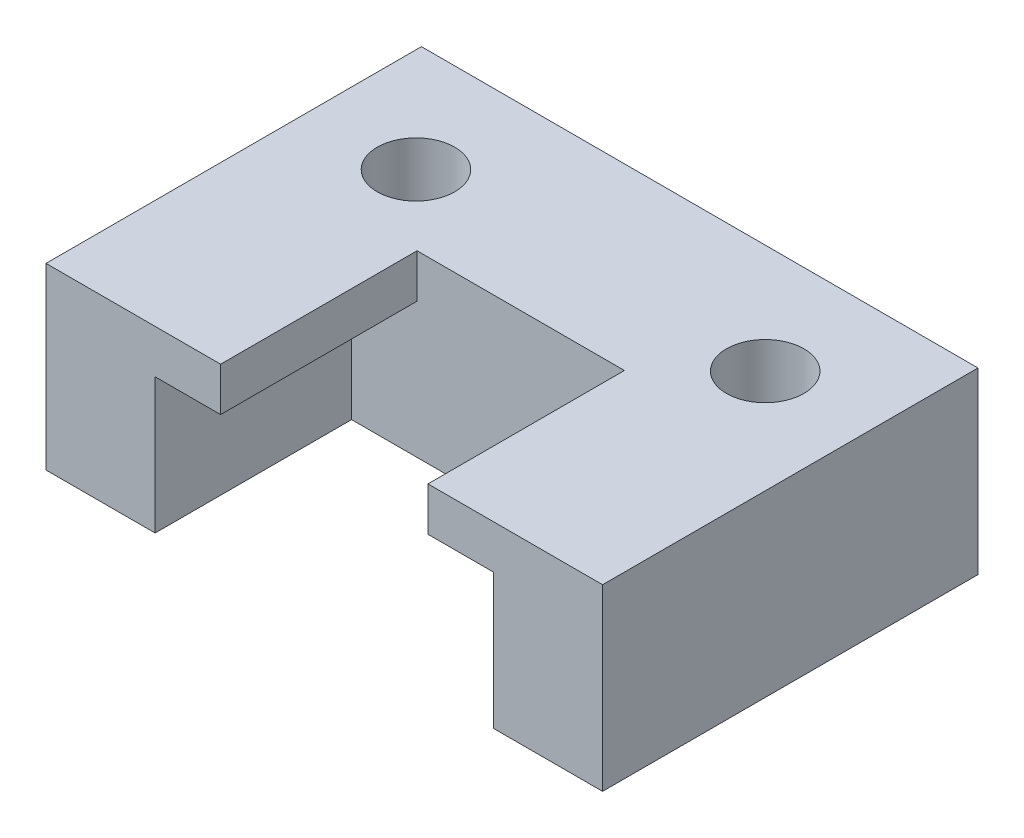
ISO-10303-21;
HEADER;
FILE_DESCRIPTION(('STEP AP214'),'2;1');
FILE_NAME('part.step','',(''),(''),'','','');
FILE_SCHEMA(('AUTOMOTIVE_DESIGN { 1 0 10303 214 1 1 1 1 }'));
ENDSEC;
DATA;
#1=APPLICATION_CONTEXT('core data for automotive mechanical design processes');
#2=APPLICATION_PROTOCOL_DEFINITION('international standard','automotive_design',2000,#1);
#3=PRODUCT_CONTEXT('',#1,'mechanical');
#4=PRODUCT('Part','Part','',(#3));
#5=PRODUCT_RELATED_PRODUCT_CATEGORY('part','',(#4));
#6=PRODUCT_DEFINITION_FORMATION('','',#4);
#7=PRODUCT_DEFINITION_CONTEXT('part definition',#1,'design');
#8=PRODUCT_DEFINITION('design','',#6,#7);
#9=PRODUCT_DEFINITION_SHAPE('','',#8);
#10=(LENGTH_UNIT() NAMED_UNIT(*) SI_UNIT(.MILLI.,.METRE.));
#11=(NAMED_UNIT(*) PLANE_ANGLE_UNIT() SI_UNIT($,.RADIAN.));
#12=(NAMED_UNIT(*) SI_UNIT($,.STERADIAN.) SOLID_ANGLE_UNIT());
#13=UNCERTAINTY_MEASURE_WITH_UNIT(LENGTH_MEASURE(1.E-05),#10,'distance_accuracy_value','');
#14=(GEOMETRIC_REPRESENTATION_CONTEXT(3) GLOBAL_UNCERTAINTY_ASSIGNED_CONTEXT((#13)) GLOBAL_UNIT_ASSIGNED_CONTEXT((#10,
#11,#12)) REPRESENTATION_CONTEXT('',''));
#15=CARTESIAN_POINT('',(0.,0.,0.));
#16=DIRECTION('',(0.,0.,1.));
#17=DIRECTION('',(1.,0.,0.));
#18=AXIS2_PLACEMENT_3D('',#15,#16,#17);
#19=CARTESIAN_POINT('',(-12.75,6.2,0.));
#20=DIRECTION('',(-1.,0.,0.));
#21=DIRECTION('',(0.,0.,1.));
#22=AXIS2_PLACEMENT_3D('',#19,#20,#21);
#23=PLANE('',#22);
#24=DIRECTION('',(0.,0.,-1.));
#25=VECTOR('',#24,1.);
#26=CARTESIAN_POINT('',(-12.75,0.,0.));
#27=LINE('',#26,#25);
#28=CARTESIAN_POINT('',(-12.75,0.,12.2));
#29=VERTEX_POINT('',#28);
#30=CARTESIAN_POINT('',(-12.75,0.,-5.));
#31=VERTEX_POINT('',#30);
#32=EDGE_CURVE('E168',#29,#31,#27,.T.);
#33=ORIENTED_EDGE('',*,*,#32,.F.);
#34=DIRECTION('',(0.,-1.,0.));
#35=VECTOR('',#34,1.);
#36=CARTESIAN_POINT('',(-12.75,6.2,12.2));
#37=LINE('',#36,#35);
#38=CARTESIAN_POINT('',(-12.75,8.2,12.2));
#39=VERTEX_POINT('',#38);
#40=EDGE_CURVE('E12',#39,#29,#37,.T.);
#41=ORIENTED_EDGE('',*,*,#40,.F.);
#42=DIRECTION('',(0.,0.,1.));
#43=VECTOR('',#42,1.);
#44=CARTESIAN_POINT('',(-12.75,8.2,0.));
#45=LINE('',#44,#43);
#46=CARTESIAN_POINT('',(-12.75,8.2,-5.));
#47=VERTEX_POINT('',#46);
#48=EDGE_CURVE('E291',#47,#39,#45,.T.);
#49=ORIENTED_EDGE('',*,*,#48,.F.);
#50=DIRECTION('',(0.,-1.,0.));
#51=VECTOR('',#50,1.);
#52=CARTESIAN_POINT('',(-12.75,6.2,-5.));
#53=LINE('',#52,#51);
#54=EDGE_CURVE('E153',#47,#31,#53,.T.);
#55=ORIENTED_EDGE('',*,*,#54,.T.);
#56=EDGE_LOOP('',(#33,#41,#49,#55));
#57=FACE_BOUND('',#56,.T.);
#58=ADVANCED_FACE('F95',(#57),#23,.T.);
#59=CARTESIAN_POINT('',(0.,6.2,12.2));
#60=DIRECTION('',(0.,0.,1.));
#61=DIRECTION('',(1.,0.,0.));
#62=AXIS2_PLACEMENT_3D('',#59,#60,#61);
#63=PLANE('',#62);
#64=DIRECTION('',(-1.,0.,0.));
#65=VECTOR('',#64,1.);
#66=CARTESIAN_POINT('',(0.,0.,12.2));
#67=LINE('',#66,#65);
#68=CARTESIAN_POINT('',(-7.75,0.,12.2));
#69=VERTEX_POINT('',#68);
#70=EDGE_CURVE('E197',#69,#29,#67,.T.);
#71=ORIENTED_EDGE('',*,*,#70,.F.);
#72=DIRECTION('',(0.,-1.,0.));
#73=VECTOR('',#72,1.);
#74=CARTESIAN_POINT('',(-7.75,6.2,12.2));
#75=LINE('',#74,#73);
#76=CARTESIAN_POINT('',(-7.75,6.2,12.2));
#77=VERTEX_POINT('',#76);
#78=EDGE_CURVE('E104',#77,#69,#75,.T.);
#79=ORIENTED_EDGE('',*,*,#78,.F.);
#80=DIRECTION('',(1.,0.,0.));
#81=VECTOR('',#80,1.);
#82=CARTESIAN_POINT('',(0.,6.2,12.2));
#83=LINE('',#82,#81);
#84=CARTESIAN_POINT('',(-4.75,6.2,12.2));
#85=VERTEX_POINT('',#84);
#86=EDGE_CURVE('E282',#77,#85,#83,.T.);
#87=ORIENTED_EDGE('',*,*,#86,.T.);
#88=DIRECTION('',(0.,-1.,0.));
#89=VECTOR('',#88,1.);
#90=CARTESIAN_POINT('',(-4.75,8.2,12.2));
#91=LINE('',#90,#89);
#92=CARTESIAN_POINT('',(-4.75,8.2,12.2));
#93=VERTEX_POINT('',#92);
#94=EDGE_CURVE('E306',#93,#85,#91,.T.);
#95=ORIENTED_EDGE('',*,*,#94,.F.);
#96=DIRECTION('',(1.,0.,0.));
#97=VECTOR('',#96,1.);
#98=CARTESIAN_POINT('',(0.,8.2,12.2));
#99=LINE('',#98,#97);
#100=EDGE_CURVE('E289',#39,#93,#99,.T.);
#101=ORIENTED_EDGE('',*,*,#100,.F.);
#102=ORIENTED_EDGE('',*,*,#40,.T.);
#103=EDGE_LOOP('',(#71,#79,#87,#95,#101,#102));
#104=FACE_BOUND('',#103,.T.);
#105=ADVANCED_FACE('F198',(#104),#63,.T.);
#106=CARTESIAN_POINT('',(-7.75,6.2,0.));
#107=DIRECTION('',(1.,0.,0.));
#108=DIRECTION('',(0.,0.,-1.));
#109=AXIS2_PLACEMENT_3D('',#106,#107,#108);
#110=PLANE('',#109);
#111=DIRECTION('',(0.,0.,1.));
#112=VECTOR('',#111,1.);
#113=CARTESIAN_POINT('',(-7.75,0.,0.));
#114=LINE('',#113,#112);
#115=CARTESIAN_POINT('',(-7.75,0.,3.2));
#116=VERTEX_POINT('',#115);
#117=EDGE_CURVE('E191',#116,#69,#114,.T.);
#118=ORIENTED_EDGE('',*,*,#117,.F.);
#119=DIRECTION('',(0.,-1.,0.));
#120=VECTOR('',#119,1.);
#121=CARTESIAN_POINT('',(-7.75,6.2,3.2));
#122=LINE('',#121,#120);
#123=CARTESIAN_POINT('',(-7.75,6.2,3.2));
#124=VERTEX_POINT('',#123);
#125=EDGE_CURVE('E183',#124,#116,#122,.T.);
#126=ORIENTED_EDGE('',*,*,#125,.F.);
#127=DIRECTION('',(0.,0.,1.));
#128=VECTOR('',#127,1.);
#129=CARTESIAN_POINT('',(-7.75,6.2,0.));
#130=LINE('',#129,#128);
#131=EDGE_CURVE('E169',#124,#77,#130,.T.);
#132=ORIENTED_EDGE('',*,*,#131,.T.);
#133=ORIENTED_EDGE('',*,*,#78,.T.);
#134=EDGE_LOOP('',(#118,#126,#132,#133));
#135=FACE_BOUND('',#134,.T.);
#136=ADVANCED_FACE('F188',(#135),#110,.T.);
#137=CARTESIAN_POINT('',(0.,6.2,3.2));
#138=DIRECTION('',(0.,0.,1.));
#139=DIRECTION('',(1.,0.,0.));
#140=AXIS2_PLACEMENT_3D('',#137,#138,#139);
#141=PLANE('',#140);
#142=DIRECTION('',(-1.,0.,0.));
#143=VECTOR('',#142,1.);
#144=CARTESIAN_POINT('',(0.,0.,3.2));
#145=LINE('',#144,#143);
#146=CARTESIAN_POINT('',(7.75,0.,3.2));
#147=VERTEX_POINT('',#146);
#148=EDGE_CURVE('E204',#147,#116,#145,.T.);
#149=ORIENTED_EDGE('',*,*,#148,.F.);
#150=DIRECTION('',(0.,-1.,0.));
#151=VECTOR('',#150,1.);
#152=CARTESIAN_POINT('',(7.75,6.2,3.2));
#153=LINE('',#152,#151);
#154=CARTESIAN_POINT('',(7.75,6.2,3.2));
#155=VERTEX_POINT('',#154);
#156=EDGE_CURVE('E181',#155,#147,#153,.T.);
#157=ORIENTED_EDGE('',*,*,#156,.F.);
#158=DIRECTION('',(-1.,0.,0.));
#159=VECTOR('',#158,1.);
#160=CARTESIAN_POINT('',(0.,6.2,3.2));
#161=LINE('',#160,#159);
#162=CARTESIAN_POINT('',(4.75,6.2,3.2));
#163=VERTEX_POINT('',#162);
#164=EDGE_CURVE('E111',#155,#163,#161,.T.);
#165=ORIENTED_EDGE('',*,*,#164,.T.);
#166=DIRECTION('',(0.,-1.,0.));
#167=VECTOR('',#166,1.);
#168=CARTESIAN_POINT('',(4.75,8.2,3.2));
#169=LINE('',#168,#167);
#170=CARTESIAN_POINT('',(4.75,8.2,3.2));
#171=VERTEX_POINT('',#170);
#172=EDGE_CURVE('E273',#171,#163,#169,.T.);
#173=ORIENTED_EDGE('',*,*,#172,.F.);
#174=DIRECTION('',(1.,0.,0.));
#175=VECTOR('',#174,1.);
#176=CARTESIAN_POINT('',(0.,8.2,3.2));
#177=LINE('',#176,#175);
#178=CARTESIAN_POINT('',(-4.75,8.2,3.2));
#179=VERTEX_POINT('',#178);
#180=EDGE_CURVE('E264',#179,#171,#177,.T.);
#181=ORIENTED_EDGE('',*,*,#180,.F.);
#182=DIRECTION('',(0.,-1.,0.));
#183=VECTOR('',#182,1.);
#184=CARTESIAN_POINT('',(-4.75,8.2,3.2));
#185=LINE('',#184,#183);
#186=CARTESIAN_POINT('',(-4.75,6.2,3.2));
#187=VERTEX_POINT('',#186);
#188=EDGE_CURVE('E276',#179,#187,#185,.T.);
#189=ORIENTED_EDGE('',*,*,#188,.T.);
#190=EDGE_CURVE('E172',#187,#124,#161,.T.);
#191=ORIENTED_EDGE('',*,*,#190,.T.);
#192=ORIENTED_EDGE('',*,*,#125,.T.);
#193=EDGE_LOOP('',(#149,#157,#165,#173,#181,#189,#191,#192));
#194=FACE_BOUND('',#193,.T.);
#195=ADVANCED_FACE('F226',(#194),#141,.T.);
#196=CARTESIAN_POINT('',(7.75,6.2,0.));
#197=DIRECTION('',(-1.,0.,0.));
#198=DIRECTION('',(0.,0.,1.));
#199=AXIS2_PLACEMENT_3D('',#196,#197,#198);
#200=PLANE('',#199);
#201=DIRECTION('',(0.,0.,-1.));
#202=VECTOR('',#201,1.);
#203=CARTESIAN_POINT('',(7.75,0.,0.));
#204=LINE('',#203,#202);
#205=CARTESIAN_POINT('',(7.75,0.,12.2));
#206=VERTEX_POINT('',#205);
#207=EDGE_CURVE('E206',#206,#147,#204,.T.);
#208=ORIENTED_EDGE('',*,*,#207,.F.);
#209=DIRECTION('',(0.,-1.,0.));
#210=VECTOR('',#209,1.);
#211=CARTESIAN_POINT('',(7.75,6.2,12.2));
#212=LINE('',#211,#210);
#213=CARTESIAN_POINT('',(7.75,6.2,12.2));
#214=VERTEX_POINT('',#213);
#215=EDGE_CURVE('E179',#214,#206,#212,.T.);
#216=ORIENTED_EDGE('',*,*,#215,.F.);
#217=DIRECTION('',(0.,0.,-1.));
#218=VECTOR('',#217,1.);
#219=CARTESIAN_POINT('',(7.75,6.2,0.));
#220=LINE('',#219,#218);
#221=EDGE_CURVE('E176',#214,#155,#220,.T.);
#222=ORIENTED_EDGE('',*,*,#221,.T.);
#223=ORIENTED_EDGE('',*,*,#156,.T.);
#224=EDGE_LOOP('',(#208,#216,#222,#223));
#225=FACE_BOUND('',#224,.T.);
#226=ADVANCED_FACE('F224',(#225),#200,.T.);
#227=CARTESIAN_POINT('',(0.,6.2,12.2));
#228=DIRECTION('',(0.,0.,1.));
#229=DIRECTION('',(1.,0.,0.));
#230=AXIS2_PLACEMENT_3D('',#227,#228,#229);
#231=PLANE('',#230);
#232=DIRECTION('',(-1.,0.,0.));
#233=VECTOR('',#232,1.);
#234=CARTESIAN_POINT('',(0.,0.,12.2));
#235=LINE('',#234,#233);
#236=CARTESIAN_POINT('',(12.75,0.,12.2));
#237=VERTEX_POINT('',#236);
#238=EDGE_CURVE('E162',#237,#206,#235,.T.);
#239=ORIENTED_EDGE('',*,*,#238,.F.);
#240=DIRECTION('',(0.,-1.,0.));
#241=VECTOR('',#240,1.);
#242=CARTESIAN_POINT('',(12.75,6.2,12.2));
#243=LINE('',#242,#241);
#244=CARTESIAN_POINT('',(12.75,8.2,12.2));
#245=VERTEX_POINT('',#244);
#246=EDGE_CURVE('E152',#245,#237,#243,.T.);
#247=ORIENTED_EDGE('',*,*,#246,.F.);
#248=DIRECTION('',(1.,0.,0.));
#249=VECTOR('',#248,1.);
#250=CARTESIAN_POINT('',(0.,8.2,12.2));
#251=LINE('',#250,#249);
#252=CARTESIAN_POINT('',(4.75,8.2,12.2));
#253=VERTEX_POINT('',#252);
#254=EDGE_CURVE('E277',#253,#245,#251,.T.);
#255=ORIENTED_EDGE('',*,*,#254,.F.);
#256=DIRECTION('',(0.,-1.,0.));
#257=VECTOR('',#256,1.);
#258=CARTESIAN_POINT('',(4.75,8.2,12.2));
#259=LINE('',#258,#257);
#260=CARTESIAN_POINT('',(4.75,6.2,12.2));
#261=VERTEX_POINT('',#260);
#262=EDGE_CURVE('E280',#253,#261,#259,.T.);
#263=ORIENTED_EDGE('',*,*,#262,.T.);
#264=DIRECTION('',(1.,0.,0.));
#265=VECTOR('',#264,1.);
#266=CARTESIAN_POINT('',(0.,6.2,12.2));
#267=LINE('',#266,#265);
#268=EDGE_CURVE('E221',#261,#214,#267,.T.);
#269=ORIENTED_EDGE('',*,*,#268,.T.);
#270=ORIENTED_EDGE('',*,*,#215,.T.);
#271=EDGE_LOOP('',(#239,#247,#255,#263,#269,#270));
#272=FACE_BOUND('',#271,.T.);
#273=ADVANCED_FACE('F212',(#272),#231,.T.);
#274=CARTESIAN_POINT('',(12.75,6.2,0.));
#275=DIRECTION('',(1.,0.,0.));
#276=DIRECTION('',(0.,0.,-1.));
#277=AXIS2_PLACEMENT_3D('',#274,#275,#276);
#278=PLANE('',#277);
#279=DIRECTION('',(0.,0.,1.));
#280=VECTOR('',#279,1.);
#281=CARTESIAN_POINT('',(12.75,0.,0.));
#282=LINE('',#281,#280);
#283=CARTESIAN_POINT('',(12.75,0.,-5.));
#284=VERTEX_POINT('',#283);
#285=EDGE_CURVE('E156',#284,#237,#282,.T.);
#286=ORIENTED_EDGE('',*,*,#285,.F.);
#287=DIRECTION('',(0.,-1.,0.));
#288=VECTOR('',#287,1.);
#289=CARTESIAN_POINT('',(12.75,6.2,-5.));
#290=LINE('',#289,#288);
#291=CARTESIAN_POINT('',(12.75,8.2,-5.));
#292=VERTEX_POINT('',#291);
#293=EDGE_CURVE('E140',#292,#284,#290,.T.);
#294=ORIENTED_EDGE('',*,*,#293,.F.);
#295=DIRECTION('',(0.,0.,-1.));
#296=VECTOR('',#295,1.);
#297=CARTESIAN_POINT('',(12.75,8.2,0.));
#298=LINE('',#297,#296);
#299=EDGE_CURVE('E295',#245,#292,#298,.T.);
#300=ORIENTED_EDGE('',*,*,#299,.F.);
#301=ORIENTED_EDGE('',*,*,#246,.T.);
#302=EDGE_LOOP('',(#286,#294,#300,#301));
#303=FACE_BOUND('',#302,.T.);
#304=ADVANCED_FACE('F157',(#303),#278,.T.);
#305=CARTESIAN_POINT('',(-8.,6.2,0.));
#306=DIRECTION('',(0.,-1.,0.));
#307=DIRECTION('',(0.,0.,-1.));
#308=AXIS2_PLACEMENT_3D('',#305,#306,#307);
#309=CYLINDRICAL_SURFACE('',#308,1.775);
#310=CARTESIAN_POINT('',(-8.,0.,0.));
#311=DIRECTION('',(0.,1.,0.));
#312=DIRECTION('',(0.,0.,1.));
#313=AXIS2_PLACEMENT_3D('',#310,#311,#312);
#314=CIRCLE('',#313,1.775);
#315=CARTESIAN_POINT('',(-8.,0.,-1.775));
#316=VERTEX_POINT('',#315);
#317=EDGE_CURVE('E314',#316,#316,#314,.T.);
#318=CARTESIAN_POINT('',(-8.,8.2,0.));
#319=DIRECTION('',(0.,1.,0.));
#320=DIRECTION('',(0.,0.,1.));
#321=AXIS2_PLACEMENT_3D('',#318,#319,#320);
#322=CIRCLE('',#321,1.775);
#323=CARTESIAN_POINT('',(-8.,8.2,-1.775));
#324=VERTEX_POINT('',#323);
#325=EDGE_CURVE('E324',#324,#324,#322,.T.);
#326=CARTESIAN_POINT('',(-8.,0.,-1.775));
#327=CARTESIAN_POINT('',(-8.,0.0854166666666664,-1.775));
#328=CARTESIAN_POINT('',(-8.,0.170833333333333,-1.775));
#329=CARTESIAN_POINT('',(-8.,0.341666666666666,-1.775));
#330=CARTESIAN_POINT('',(-8.,0.427083333333333,-1.775));
#331=CARTESIAN_POINT('',(-8.,0.597916666666667,-1.775));
#332=CARTESIAN_POINT('',(-8.,0.683333333333334,-1.775));
#333=CARTESIAN_POINT('',(-8.,0.854166666666667,-1.775));
#334=CARTESIAN_POINT('',(-8.,0.939583333333333,-1.775));
#335=CARTESIAN_POINT('',(-8.,1.11041666666667,-1.775));
#336=CARTESIAN_POINT('',(-8.,1.19583333333333,-1.775));
#337=CARTESIAN_POINT('',(-8.,1.36666666666667,-1.775));
#338=CARTESIAN_POINT('',(-8.,1.45208333333333,-1.775));
#339=CARTESIAN_POINT('',(-8.,1.62291666666667,-1.775));
#340=CARTESIAN_POINT('',(-8.,1.70833333333333,-1.775));
#341=CARTESIAN_POINT('',(-8.,1.87916666666667,-1.775));
#342=CARTESIAN_POINT('',(-8.,1.96458333333333,-1.775));
#343=CARTESIAN_POINT('',(-8.,2.13541666666667,-1.775));
#344=CARTESIAN_POINT('',(-8.,2.22083333333333,-1.775));
#345=CARTESIAN_POINT('',(-8.,2.39166666666667,-1.775));
#346=CARTESIAN_POINT('',(-8.,2.47708333333333,-1.775));
#347=CARTESIAN_POINT('',(-8.,2.64791666666667,-1.775));
#348=CARTESIAN_POINT('',(-8.,2.73333333333333,-1.775));
#349=CARTESIAN_POINT('',(-8.,2.90416666666667,-1.775));
#350=CARTESIAN_POINT('',(-8.,2.98958333333333,-1.775));
#351=CARTESIAN_POINT('',(-8.,3.16041666666667,-1.775));
#352=CARTESIAN_POINT('',(-8.,3.24583333333333,-1.775));
#353=CARTESIAN_POINT('',(-8.,3.41666666666667,-1.775));
#354=CARTESIAN_POINT('',(-8.,3.50208333333333,-1.775));
#355=CARTESIAN_POINT('',(-8.,3.67291666666667,-1.775));
#356=CARTESIAN_POINT('',(-8.,3.75833333333333,-1.775));
#357=CARTESIAN_POINT('',(-8.,3.92916666666667,-1.775));
#358=CARTESIAN_POINT('',(-8.,4.01458333333333,-1.775));
#359=CARTESIAN_POINT('',(-8.,4.18541666666667,-1.775));
#360=CARTESIAN_POINT('',(-8.,4.27083333333333,-1.775));
#361=CARTESIAN_POINT('',(-8.,4.44166666666666,-1.775));
#362=CARTESIAN_POINT('',(-8.,4.52708333333333,-1.775));
#363=CARTESIAN_POINT('',(-8.,4.69791666666667,-1.775));
#364=CARTESIAN_POINT('',(-8.,4.78333333333333,-1.775));
#365=CARTESIAN_POINT('',(-8.,4.95416666666667,-1.775));
#366=CARTESIAN_POINT('',(-8.,5.03958333333333,-1.775));
#367=CARTESIAN_POINT('',(-8.,5.21041666666667,-1.775));
#368=CARTESIAN_POINT('',(-8.,5.29583333333333,-1.775));
#369=CARTESIAN_POINT('',(-8.,5.46666666666667,-1.775));
#370=CARTESIAN_POINT('',(-8.,5.55208333333333,-1.775));
#371=CARTESIAN_POINT('',(-8.,5.72291666666667,-1.775));
#372=CARTESIAN_POINT('',(-8.,5.80833333333333,-1.775));
#373=CARTESIAN_POINT('',(-8.,5.97916666666667,-1.775));
#374=CARTESIAN_POINT('',(-8.,6.06458333333333,-1.775));
#375=CARTESIAN_POINT('',(-8.,6.23541666666666,-1.775));
#376=CARTESIAN_POINT('',(-8.,6.32083333333333,-1.775));
#377=CARTESIAN_POINT('',(-8.,6.49166666666666,-1.775));
#378=CARTESIAN_POINT('',(-8.,6.57708333333333,-1.775));
#379=CARTESIAN_POINT('',(-8.,6.74791666666667,-1.775));
#380=CARTESIAN_POINT('',(-8.,6.83333333333333,-1.775));
#381=CARTESIAN_POINT('',(-8.,7.00416666666667,-1.775));
#382=CARTESIAN_POINT('',(-8.,7.08958333333333,-1.775));
#383=CARTESIAN_POINT('',(-8.,7.26041666666667,-1.775));
#384=CARTESIAN_POINT('',(-8.,7.34583333333333,-1.775));
#385=CARTESIAN_POINT('',(-8.,7.51666666666666,-1.775));
#386=CARTESIAN_POINT('',(-8.,7.60208333333333,-1.775));
#387=CARTESIAN_POINT('',(-8.,7.77291666666667,-1.775));
#388=CARTESIAN_POINT('',(-8.,7.85833333333333,-1.775));
#389=CARTESIAN_POINT('',(-8.,8.02916666666666,-1.775));
#390=CARTESIAN_POINT('',(-8.,8.11458333333333,-1.775));
#391=CARTESIAN_POINT('',(-8.,8.2,-1.775));
#392=B_SPLINE_CURVE_WITH_KNOTS('',3,(#326,#327,#328,#329,#330,#331,#332,#333,#334,#335,#336,
#337,#338,#339,#340,#341,#342,#343,#344,#345,#346,#347,#348,#349,#350,#351,#352,#353,#354,#355,
#356,#357,#358,#359,#360,#361,#362,#363,#364,#365,#366,#367,#368,#369,#370,#371,#372,#373,#374,
#375,#376,#377,#378,#379,#380,#381,#382,#383,#384,#385,#386,#387,#388,#389,#390,#391),
.UNSPECIFIED.,.F.,.F.,(4,2,2,2,2,2,2,2,2,2,2,2,2,2,2,2,2,2,2,2,2,2,2,2,2,2,2,2,2,2,2,2,4),(0.,
0.25625,0.5125,0.76875,1.025,1.28125,1.5375,1.79375,2.05,2.30625,2.5625,2.81875,3.075,3.33125,
3.5875,3.84375,4.1,4.35625,4.6125,4.86875,5.125,5.38125,5.6375,5.89375,6.15,6.40625,6.6625,
6.91875,7.175,7.43125,7.6875,7.94375,8.2),.UNSPECIFIED.);
#393=EDGE_CURVE('BSEAM319',#316,#324,#392,.T.);
#394=ORIENTED_EDGE('',*,*,#317,.F.);
#395=ORIENTED_EDGE('',*,*,#325,.T.);
#396=ORIENTED_EDGE('',*,*,#393,.T.);
#397=ORIENTED_EDGE('',*,*,#393,.F.);
#398=EDGE_LOOP('',(#394,#396,#395,#397));
#399=FACE_BOUND('',#398,.T.);
#400=ADVANCED_FACE('F319',(#399),#309,.F.);
#401=CARTESIAN_POINT('',(8.,6.2,0.));
#402=DIRECTION('',(0.,-1.,0.));
#403=DIRECTION('',(0.,0.,-1.));
#404=AXIS2_PLACEMENT_3D('',#401,#402,#403);
#405=CYLINDRICAL_SURFACE('',#404,1.775);
#406=CARTESIAN_POINT('',(8.,0.,0.));
#407=DIRECTION('',(0.,1.,0.));
#408=DIRECTION('',(0.,0.,1.));
#409=AXIS2_PLACEMENT_3D('',#406,#407,#408);
#410=CIRCLE('',#409,1.775);
#411=CARTESIAN_POINT('',(8.,0.,-1.775));
#412=VERTEX_POINT('',#411);
#413=EDGE_CURVE('E305',#412,#412,#410,.T.);
#414=CARTESIAN_POINT('',(8.,8.2,0.));
#415=DIRECTION('',(0.,1.,0.));
#416=DIRECTION('',(0.,0.,1.));
#417=AXIS2_PLACEMENT_3D('',#414,#415,#416);
#418=CIRCLE('',#417,1.775);
#419=CARTESIAN_POINT('',(8.,8.2,-1.775));
#420=VERTEX_POINT('',#419);
#421=EDGE_CURVE('E285',#420,#420,#418,.T.);
#422=CARTESIAN_POINT('',(8.,0.,-1.775));
#423=CARTESIAN_POINT('',(8.,0.0854166666666664,-1.775));
#424=CARTESIAN_POINT('',(8.,0.170833333333333,-1.775));
#425=CARTESIAN_POINT('',(8.,0.341666666666666,-1.775));
#426=CARTESIAN_POINT('',(8.,0.427083333333333,-1.775));
#427=CARTESIAN_POINT('',(8.,0.597916666666667,-1.775));
#428=CARTESIAN_POINT('',(8.,0.683333333333334,-1.775));
#429=CARTESIAN_POINT('',(8.,0.854166666666667,-1.775));
#430=CARTESIAN_POINT('',(8.,0.939583333333333,-1.775));
#431=CARTESIAN_POINT('',(8.,1.11041666666667,-1.775));
#432=CARTESIAN_POINT('',(8.,1.19583333333333,-1.775));
#433=CARTESIAN_POINT('',(8.,1.36666666666667,-1.775));
#434=CARTESIAN_POINT('',(8.,1.45208333333333,-1.775));
#435=CARTESIAN_POINT('',(8.,1.62291666666667,-1.775));
#436=CARTESIAN_POINT('',(8.,1.70833333333333,-1.775));
#437=CARTESIAN_POINT('',(8.,1.87916666666667,-1.775));
#438=CARTESIAN_POINT('',(8.,1.96458333333333,-1.775));
#439=CARTESIAN_POINT('',(8.,2.13541666666667,-1.775));
#440=CARTESIAN_POINT('',(8.,2.22083333333333,-1.775));
#441=CARTESIAN_POINT('',(8.,2.39166666666667,-1.775));
#442=CARTESIAN_POINT('',(8.,2.47708333333333,-1.775));
#443=CARTESIAN_POINT('',(8.,2.64791666666667,-1.775));
#444=CARTESIAN_POINT('',(8.,2.73333333333333,-1.775));
#445=CARTESIAN_POINT('',(8.,2.90416666666667,-1.775));
#446=CARTESIAN_POINT('',(8.,2.98958333333333,-1.775));
#447=CARTESIAN_POINT('',(8.,3.16041666666667,-1.775));
#448=CARTESIAN_POINT('',(8.,3.24583333333333,-1.775));
#449=CARTESIAN_POINT('',(8.,3.41666666666667,-1.775));
#450=CARTESIAN_POINT('',(8.,3.50208333333333,-1.775));
#451=CARTESIAN_POINT('',(8.,3.67291666666667,-1.775));
#452=CARTESIAN_POINT('',(8.,3.75833333333333,-1.775));
#453=CARTESIAN_POINT('',(8.,3.92916666666667,-1.775));
#454=CARTESIAN_POINT('',(8.,4.01458333333333,-1.775));
#455=CARTESIAN_POINT('',(8.,4.18541666666667,-1.775));
#456=CARTESIAN_POINT('',(8.,4.27083333333333,-1.775));
#457=CARTESIAN_POINT('',(8.,4.44166666666666,-1.775));
#458=CARTESIAN_POINT('',(8.,4.52708333333333,-1.775));
#459=CARTESIAN_POINT('',(8.,4.69791666666667,-1.775));
#460=CARTESIAN_POINT('',(8.,4.78333333333333,-1.775));
#461=CARTESIAN_POINT('',(8.,4.95416666666667,-1.775));
#462=CARTESIAN_POINT('',(8.,5.03958333333333,-1.775));
#463=CARTESIAN_POINT('',(8.,5.21041666666667,-1.775));
#464=CARTESIAN_POINT('',(8.,5.29583333333333,-1.775));
#465=CARTESIAN_POINT('',(8.,5.46666666666667,-1.775));
#466=CARTESIAN_POINT('',(8.,5.55208333333333,-1.775));
#467=CARTESIAN_POINT('',(8.,5.72291666666667,-1.775));
#468=CARTESIAN_POINT('',(8.,5.80833333333333,-1.775));
#469=CARTESIAN_POINT('',(8.,5.97916666666667,-1.775));
#470=CARTESIAN_POINT('',(8.,6.06458333333333,-1.775));
#471=CARTESIAN_POINT('',(8.,6.23541666666666,-1.775));
#472=CARTESIAN_POINT('',(8.,6.32083333333333,-1.775));
#473=CARTESIAN_POINT('',(8.,6.49166666666666,-1.775));
#474=CARTESIAN_POINT('',(8.,6.57708333333333,-1.775));
#475=CARTESIAN_POINT('',(8.,6.74791666666667,-1.775));
#476=CARTESIAN_POINT('',(8.,6.83333333333333,-1.775));
#477=CARTESIAN_POINT('',(8.,7.00416666666667,-1.775));
#478=CARTESIAN_POINT('',(8.,7.08958333333333,-1.775));
#479=CARTESIAN_POINT('',(8.,7.26041666666667,-1.775));
#480=CARTESIAN_POINT('',(8.,7.34583333333333,-1.775));
#481=CARTESIAN_POINT('',(8.,7.51666666666666,-1.775));
#482=CARTESIAN_POINT('',(8.,7.60208333333333,-1.775));
#483=CARTESIAN_POINT('',(8.,7.77291666666667,-1.775));
#484=CARTESIAN_POINT('',(8.,7.85833333333333,-1.775));
#485=CARTESIAN_POINT('',(8.,8.02916666666666,-1.775));
#486=CARTESIAN_POINT('',(8.,8.11458333333333,-1.775));
#487=CARTESIAN_POINT('',(8.,8.2,-1.775));
#488=B_SPLINE_CURVE_WITH_KNOTS('',3,(#422,#423,#424,#425,#426,#427,#428,#429,#430,#431,#432,
#433,#434,#435,#436,#437,#438,#439,#440,#441,#442,#443,#444,#445,#446,#447,#448,#449,#450,#451,
#452,#453,#454,#455,#456,#457,#458,#459,#460,#461,#462,#463,#464,#465,#466,#467,#468,#469,#470,
#471,#472,#473,#474,#475,#476,#477,#478,#479,#480,#481,#482,#483,#484,#485,#486,#487),
.UNSPECIFIED.,.F.,.F.,(4,2,2,2,2,2,2,2,2,2,2,2,2,2,2,2,2,2,2,2,2,2,2,2,2,2,2,2,2,2,2,2,4),(0.,
0.25625,0.5125,0.76875,1.025,1.28125,1.5375,1.79375,2.05,2.30625,2.5625,2.81875,3.075,3.33125,
3.5875,3.84375,4.1,4.35625,4.6125,4.86875,5.125,5.38125,5.6375,5.89375,6.15,6.40625,6.6625,
6.91875,7.175,7.43125,7.6875,7.94375,8.2),.UNSPECIFIED.);
#489=EDGE_CURVE('BSEAM97',#412,#420,#488,.T.);
#490=ORIENTED_EDGE('',*,*,#413,.F.);
#491=ORIENTED_EDGE('',*,*,#421,.T.);
#492=ORIENTED_EDGE('',*,*,#489,.T.);
#493=ORIENTED_EDGE('',*,*,#489,.F.);
#494=EDGE_LOOP('',(#490,#492,#491,#493));
#495=FACE_BOUND('',#494,.T.);
#496=ADVANCED_FACE('F97',(#495),#405,.F.);
#497=CARTESIAN_POINT('',(0.,6.2,-5.));
#498=DIRECTION('',(0.,0.,-1.));
#499=DIRECTION('',(-1.,0.,0.));
#500=AXIS2_PLACEMENT_3D('',#497,#498,#499);
#501=PLANE('',#500);
#502=DIRECTION('',(1.,0.,0.));
#503=VECTOR('',#502,1.);
#504=CARTESIAN_POINT('',(0.,0.,-5.));
#505=LINE('',#504,#503);
#506=EDGE_CURVE('E145',#31,#284,#505,.T.);
#507=ORIENTED_EDGE('',*,*,#506,.F.);
#508=ORIENTED_EDGE('',*,*,#54,.F.);
#509=DIRECTION('',(-1.,0.,0.));
#510=VECTOR('',#509,1.);
#511=CARTESIAN_POINT('',(0.,8.2,-5.));
#512=LINE('',#511,#510);
#513=EDGE_CURVE('E148',#292,#47,#512,.T.);
#514=ORIENTED_EDGE('',*,*,#513,.F.);
#515=ORIENTED_EDGE('',*,*,#293,.T.);
#516=EDGE_LOOP('',(#507,#508,#514,#515));
#517=FACE_BOUND('',#516,.T.);
#518=ADVANCED_FACE('F142',(#517),#501,.T.);
#519=CARTESIAN_POINT('',(0.,0.,0.));
#520=DIRECTION('',(0.,1.,0.));
#521=DIRECTION('',(0.,0.,1.));
#522=AXIS2_PLACEMENT_3D('',#519,#520,#521);
#523=PLANE('',#522);
#524=ORIENTED_EDGE('',*,*,#413,.T.);
#525=EDGE_LOOP('',(#524));
#526=FACE_BOUND('',#525,.T.);
#527=ORIENTED_EDGE('',*,*,#317,.T.);
#528=EDGE_LOOP('',(#527));
#529=FACE_BOUND('',#528,.T.);
#530=ORIENTED_EDGE('',*,*,#32,.T.);
#531=ORIENTED_EDGE('',*,*,#506,.T.);
#532=ORIENTED_EDGE('',*,*,#285,.T.);
#533=ORIENTED_EDGE('',*,*,#238,.T.);
#534=ORIENTED_EDGE('',*,*,#207,.T.);
#535=ORIENTED_EDGE('',*,*,#148,.T.);
#536=ORIENTED_EDGE('',*,*,#117,.T.);
#537=ORIENTED_EDGE('',*,*,#70,.T.);
#538=EDGE_LOOP('',(#530,#531,#532,#533,#534,#535,#536,#537));
#539=FACE_BOUND('',#538,.T.);
#540=ADVANCED_FACE('F165',(#526,#529,#539),#523,.F.);
#541=CARTESIAN_POINT('',(0.,6.2,0.));
#542=DIRECTION('',(0.,-1.,0.));
#543=DIRECTION('',(0.,0.,-1.));
#544=AXIS2_PLACEMENT_3D('',#541,#542,#543);
#545=PLANE('',#544);
#546=ORIENTED_EDGE('',*,*,#131,.F.);
#547=ORIENTED_EDGE('',*,*,#190,.F.);
#548=DIRECTION('',(0.,0.,1.));
#549=VECTOR('',#548,1.);
#550=CARTESIAN_POINT('',(-4.75,6.2,0.));
#551=LINE('',#550,#549);
#552=EDGE_CURVE('E300',#187,#85,#551,.T.);
#553=ORIENTED_EDGE('',*,*,#552,.T.);
#554=ORIENTED_EDGE('',*,*,#86,.F.);
#555=EDGE_LOOP('',(#546,#547,#553,#554));
#556=FACE_BOUND('',#555,.T.);
#557=ADVANCED_FACE('F338',(#556),#545,.T.);
#558=ORIENTED_EDGE('',*,*,#164,.F.);
#559=ORIENTED_EDGE('',*,*,#221,.F.);
#560=ORIENTED_EDGE('',*,*,#268,.F.);
#561=DIRECTION('',(0.,0.,-1.));
#562=VECTOR('',#561,1.);
#563=CARTESIAN_POINT('',(4.75,6.2,0.));
#564=LINE('',#563,#562);
#565=EDGE_CURVE('E298',#261,#163,#564,.T.);
#566=ORIENTED_EDGE('',*,*,#565,.T.);
#567=EDGE_LOOP('',(#558,#559,#560,#566));
#568=FACE_BOUND('',#567,.T.);
#569=ADVANCED_FACE('F330',(#568),#545,.T.);
#570=CARTESIAN_POINT('',(0.,8.2,0.));
#571=DIRECTION('',(0.,-1.,0.));
#572=DIRECTION('',(0.,0.,-1.));
#573=AXIS2_PLACEMENT_3D('',#570,#571,#572);
#574=PLANE('',#573);
#575=DIRECTION('',(0.,0.,-1.));
#576=VECTOR('',#575,1.);
#577=CARTESIAN_POINT('',(4.75,8.2,0.));
#578=LINE('',#577,#576);
#579=EDGE_CURVE('E269',#253,#171,#578,.T.);
#580=ORIENTED_EDGE('',*,*,#579,.F.);
#581=ORIENTED_EDGE('',*,*,#254,.T.);
#582=ORIENTED_EDGE('',*,*,#299,.T.);
#583=ORIENTED_EDGE('',*,*,#513,.T.);
#584=ORIENTED_EDGE('',*,*,#48,.T.);
#585=ORIENTED_EDGE('',*,*,#100,.T.);
#586=DIRECTION('',(0.,0.,1.));
#587=VECTOR('',#586,1.);
#588=CARTESIAN_POINT('',(-4.75,8.2,0.));
#589=LINE('',#588,#587);
#590=EDGE_CURVE('E271',#179,#93,#589,.T.);
#591=ORIENTED_EDGE('',*,*,#590,.F.);
#592=ORIENTED_EDGE('',*,*,#180,.T.);
#593=EDGE_LOOP('',(#580,#581,#582,#583,#584,#585,#591,#592));
#594=FACE_BOUND('',#593,.T.);
#595=ORIENTED_EDGE('',*,*,#421,.F.);
#596=EDGE_LOOP('',(#595));
#597=FACE_BOUND('',#596,.T.);
#598=ORIENTED_EDGE('',*,*,#325,.F.);
#599=EDGE_LOOP('',(#598));
#600=FACE_BOUND('',#599,.T.);
#601=ADVANCED_FACE('F266',(#594,#597,#600),#574,.F.);
#602=CARTESIAN_POINT('',(4.75,8.2,0.));
#603=DIRECTION('',(-1.,0.,0.));
#604=DIRECTION('',(0.,0.,1.));
#605=AXIS2_PLACEMENT_3D('',#602,#603,#604);
#606=PLANE('',#605);
#607=ORIENTED_EDGE('',*,*,#565,.F.);
#608=ORIENTED_EDGE('',*,*,#262,.F.);
#609=ORIENTED_EDGE('',*,*,#579,.T.);
#610=ORIENTED_EDGE('',*,*,#172,.T.);
#611=EDGE_LOOP('',(#607,#608,#609,#610));
#612=FACE_BOUND('',#611,.T.);
#613=ADVANCED_FACE('F279',(#612),#606,.T.);
#614=CARTESIAN_POINT('',(-4.75,8.2,0.));
#615=DIRECTION('',(1.,0.,0.));
#616=DIRECTION('',(0.,0.,-1.));
#617=AXIS2_PLACEMENT_3D('',#614,#615,#616);
#618=PLANE('',#617);
#619=ORIENTED_EDGE('',*,*,#552,.F.);
#620=ORIENTED_EDGE('',*,*,#188,.F.);
#621=ORIENTED_EDGE('',*,*,#590,.T.);
#622=ORIENTED_EDGE('',*,*,#94,.T.);
#623=EDGE_LOOP('',(#619,#620,#621,#622));
#624=FACE_BOUND('',#623,.T.);
#625=ADVANCED_FACE('F336',(#624),#618,.T.);
#626=CLOSED_SHELL('',(#58,#105,#136,#195,#226,#273,#304,#400,#496,#518,#540,#557,#569,#601,#613,#625));
#627=MANIFOLD_SOLID_BREP('B2',#626);
#628=ADVANCED_BREP_SHAPE_REPRESENTATION('',(#18,#627),#14);
#629=SHAPE_DEFINITION_REPRESENTATION(#9,#628);
ENDSEC;
END-ISO-10303-21;
